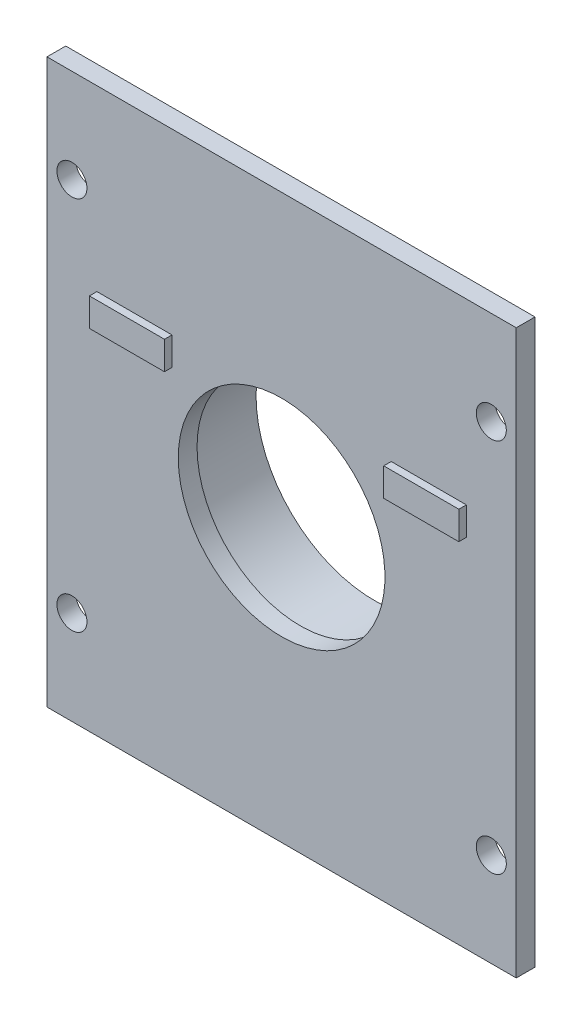
ISO-10303-21;
HEADER;
FILE_DESCRIPTION(('STEP AP214'),'2;1');
FILE_NAME('part.step','',(''),(''),'','','');
FILE_SCHEMA(('AUTOMOTIVE_DESIGN { 1 0 10303 214 1 1 1 1 }'));
ENDSEC;
DATA;
#1=APPLICATION_CONTEXT('core data for automotive mechanical design processes');
#2=APPLICATION_PROTOCOL_DEFINITION('international standard','automotive_design',2000,#1);
#3=PRODUCT_CONTEXT('',#1,'mechanical');
#4=PRODUCT('Part','Part','',(#3));
#5=PRODUCT_RELATED_PRODUCT_CATEGORY('part','',(#4));
#6=PRODUCT_DEFINITION_FORMATION('','',#4);
#7=PRODUCT_DEFINITION_CONTEXT('part definition',#1,'design');
#8=PRODUCT_DEFINITION('design','',#6,#7);
#9=PRODUCT_DEFINITION_SHAPE('','',#8);
#10=(LENGTH_UNIT() NAMED_UNIT(*) SI_UNIT(.MILLI.,.METRE.));
#11=(NAMED_UNIT(*) PLANE_ANGLE_UNIT() SI_UNIT($,.RADIAN.));
#12=(NAMED_UNIT(*) SI_UNIT($,.STERADIAN.) SOLID_ANGLE_UNIT());
#13=UNCERTAINTY_MEASURE_WITH_UNIT(LENGTH_MEASURE(1.E-05),#10,'distance_accuracy_value','');
#14=(GEOMETRIC_REPRESENTATION_CONTEXT(3) GLOBAL_UNCERTAINTY_ASSIGNED_CONTEXT((#13)) GLOBAL_UNIT_ASSIGNED_CONTEXT((#10,
#11,#12)) REPRESENTATION_CONTEXT('',''));
#15=CARTESIAN_POINT('',(0.,0.,0.));
#16=DIRECTION('',(0.,0.,1.));
#17=DIRECTION('',(1.,0.,0.));
#18=AXIS2_PLACEMENT_3D('',#15,#16,#17);
#19=CARTESIAN_POINT('',(0.,0.,2.54));
#20=DIRECTION('',(0.,0.,-1.));
#21=DIRECTION('',(-1.,0.,0.));
#22=AXIS2_PLACEMENT_3D('',#19,#20,#21);
#23=PLANE('',#22);
#24=DIRECTION('',(-1.,0.,0.));
#25=VECTOR('',#24,1.);
#26=CARTESIAN_POINT('',(46.5836,52.07,2.54));
#27=LINE('',#26,#25);
#28=CARTESIAN_POINT('',(56.7436,52.07,2.54));
#29=VERTEX_POINT('',#28);
#30=CARTESIAN_POINT('',(46.5836,52.07,2.54));
#31=VERTEX_POINT('',#30);
#32=EDGE_CURVE('E143',#29,#31,#27,.T.);
#33=ORIENTED_EDGE('',*,*,#32,.F.);
#34=DIRECTION('',(0.,1.,0.));
#35=VECTOR('',#34,1.);
#36=CARTESIAN_POINT('',(56.7436,52.07,2.54));
#37=LINE('',#36,#35);
#38=CARTESIAN_POINT('',(56.7436,48.26,2.54));
#39=VERTEX_POINT('',#38);
#40=EDGE_CURVE('E156',#39,#29,#37,.T.);
#41=ORIENTED_EDGE('',*,*,#40,.F.);
#42=DIRECTION('',(1.,0.,0.));
#43=VECTOR('',#42,1.);
#44=CARTESIAN_POINT('',(46.5836,48.26,2.54));
#45=LINE('',#44,#43);
#46=CARTESIAN_POINT('',(46.5836,48.26,2.54));
#47=VERTEX_POINT('',#46);
#48=EDGE_CURVE('E165',#47,#39,#45,.T.);
#49=ORIENTED_EDGE('',*,*,#48,.F.);
#50=DIRECTION('',(0.,-1.,0.));
#51=VECTOR('',#50,1.);
#52=CARTESIAN_POINT('',(46.5836,48.26,2.54));
#53=LINE('',#52,#51);
#54=EDGE_CURVE('E146',#31,#47,#53,.T.);
#55=ORIENTED_EDGE('',*,*,#54,.F.);
#56=EDGE_LOOP('',(#33,#41,#49,#55));
#57=FACE_BOUND('',#56,.T.);
#58=CARTESIAN_POINT('',(3.375,12.7,2.54));
#59=DIRECTION('',(0.,0.,-1.));
#60=DIRECTION('',(1.,0.,0.));
#61=AXIS2_PLACEMENT_3D('',#58,#59,#60);
#62=CIRCLE('',#61,2.032);
#63=CARTESIAN_POINT('',(5.407,12.7,2.54));
#64=VERTEX_POINT('',#63);
#65=EDGE_CURVE('E182',#64,#64,#62,.T.);
#66=ORIENTED_EDGE('',*,*,#65,.T.);
#67=EDGE_LOOP('',(#66));
#68=FACE_BOUND('',#67,.T.);
#69=CARTESIAN_POINT('',(60.125,12.7,2.54));
#70=DIRECTION('',(0.,0.,-1.));
#71=DIRECTION('',(-1.,0.,0.));
#72=AXIS2_PLACEMENT_3D('',#69,#70,#71);
#73=CIRCLE('',#72,2.03200000000002);
#74=CARTESIAN_POINT('',(58.093,12.7,2.54));
#75=VERTEX_POINT('',#74);
#76=EDGE_CURVE('E188',#75,#75,#73,.T.);
#77=ORIENTED_EDGE('',*,*,#76,.T.);
#78=EDGE_LOOP('',(#77));
#79=FACE_BOUND('',#78,.T.);
#80=CARTESIAN_POINT('',(60.125,63.5,2.54));
#81=DIRECTION('',(0.,0.,-1.));
#82=DIRECTION('',(1.,0.,0.));
#83=AXIS2_PLACEMENT_3D('',#80,#81,#82);
#84=CIRCLE('',#83,2.03200000000002);
#85=CARTESIAN_POINT('',(62.157,63.5,2.54));
#86=VERTEX_POINT('',#85);
#87=EDGE_CURVE('E194',#86,#86,#84,.T.);
#88=ORIENTED_EDGE('',*,*,#87,.T.);
#89=EDGE_LOOP('',(#88));
#90=FACE_BOUND('',#89,.T.);
#91=CARTESIAN_POINT('',(3.37500000000002,63.5,2.54));
#92=DIRECTION('',(0.,0.,-1.));
#93=DIRECTION('',(-1.,0.,0.));
#94=AXIS2_PLACEMENT_3D('',#91,#92,#93);
#95=CIRCLE('',#94,2.032);
#96=CARTESIAN_POINT('',(1.34300000000001,63.5,2.54));
#97=VERTEX_POINT('',#96);
#98=EDGE_CURVE('E200',#97,#97,#95,.T.);
#99=ORIENTED_EDGE('',*,*,#98,.T.);
#100=EDGE_LOOP('',(#99));
#101=FACE_BOUND('',#100,.T.);
#102=CARTESIAN_POINT('',(31.75,38.1,2.54));
#103=DIRECTION('',(0.,0.,-1.));
#104=DIRECTION('',(-1.,0.,0.));
#105=AXIS2_PLACEMENT_3D('',#102,#103,#104);
#106=CIRCLE('',#105,13.983999972);
#107=CARTESIAN_POINT('',(17.766000028,38.1,2.54));
#108=VERTEX_POINT('',#107);
#109=EDGE_CURVE('E208',#108,#108,#106,.T.);
#110=ORIENTED_EDGE('',*,*,#109,.T.);
#111=EDGE_LOOP('',(#110));
#112=FACE_BOUND('',#111,.T.);
#113=DIRECTION('',(0.,-1.,0.));
#114=VECTOR('',#113,1.);
#115=CARTESIAN_POINT('',(0.,0.,2.54));
#116=LINE('',#115,#114);
#117=CARTESIAN_POINT('',(0.,76.2,2.54));
#118=VERTEX_POINT('',#117);
#119=CARTESIAN_POINT('',(0.,0.,2.54));
#120=VERTEX_POINT('',#119);
#121=EDGE_CURVE('E221',#118,#120,#116,.T.);
#122=ORIENTED_EDGE('',*,*,#121,.T.);
#123=DIRECTION('',(1.,0.,0.));
#124=VECTOR('',#123,1.);
#125=CARTESIAN_POINT('',(0.,0.,2.54));
#126=LINE('',#125,#124);
#127=CARTESIAN_POINT('',(63.5,0.,2.54));
#128=VERTEX_POINT('',#127);
#129=EDGE_CURVE('E224',#120,#128,#126,.T.);
#130=ORIENTED_EDGE('',*,*,#129,.T.);
#131=DIRECTION('',(0.,1.,0.));
#132=VECTOR('',#131,1.);
#133=CARTESIAN_POINT('',(63.5,0.,2.54));
#134=LINE('',#133,#132);
#135=CARTESIAN_POINT('',(63.5,76.2,2.54));
#136=VERTEX_POINT('',#135);
#137=EDGE_CURVE('E227',#128,#136,#134,.T.);
#138=ORIENTED_EDGE('',*,*,#137,.T.);
#139=DIRECTION('',(-1.,0.,0.));
#140=VECTOR('',#139,1.);
#141=CARTESIAN_POINT('',(0.,76.2,2.54));
#142=LINE('',#141,#140);
#143=EDGE_CURVE('E229',#136,#118,#142,.T.);
#144=ORIENTED_EDGE('',*,*,#143,.T.);
#145=EDGE_LOOP('',(#122,#130,#138,#144));
#146=FACE_BOUND('',#145,.T.);
#147=DIRECTION('',(1.,0.,0.));
#148=VECTOR('',#147,1.);
#149=CARTESIAN_POINT('',(6.7564,48.26,2.54));
#150=LINE('',#149,#148);
#151=CARTESIAN_POINT('',(6.7564,48.26,2.54));
#152=VERTEX_POINT('',#151);
#153=CARTESIAN_POINT('',(16.9164,48.26,2.54));
#154=VERTEX_POINT('',#153);
#155=EDGE_CURVE('E142',#152,#154,#150,.T.);
#156=ORIENTED_EDGE('',*,*,#155,.F.);
#157=DIRECTION('',(0.,-1.,0.));
#158=VECTOR('',#157,1.);
#159=CARTESIAN_POINT('',(6.7564,52.07,2.54));
#160=LINE('',#159,#158);
#161=CARTESIAN_POINT('',(6.7564,52.07,2.54));
#162=VERTEX_POINT('',#161);
#163=EDGE_CURVE('E139',#162,#152,#160,.T.);
#164=ORIENTED_EDGE('',*,*,#163,.F.);
#165=DIRECTION('',(-1.,0.,0.));
#166=VECTOR('',#165,1.);
#167=CARTESIAN_POINT('',(16.9164,52.07,2.54));
#168=LINE('',#167,#166);
#169=CARTESIAN_POINT('',(16.9164,52.07,2.54));
#170=VERTEX_POINT('',#169);
#171=EDGE_CURVE('E53',#170,#162,#168,.T.);
#172=ORIENTED_EDGE('',*,*,#171,.F.);
#173=DIRECTION('',(0.,1.,0.));
#174=VECTOR('',#173,1.);
#175=CARTESIAN_POINT('',(16.9164,48.26,2.54));
#176=LINE('',#175,#174);
#177=EDGE_CURVE('E48',#154,#170,#176,.T.);
#178=ORIENTED_EDGE('',*,*,#177,.F.);
#179=EDGE_LOOP('',(#156,#164,#172,#178));
#180=FACE_BOUND('',#179,.T.);
#181=ADVANCED_FACE('F33',(#57,#68,#79,#90,#101,#112,#146,#180),#23,.F.);
#182=CARTESIAN_POINT('',(0.,0.,0.));
#183=DIRECTION('',(0.,0.,-1.));
#184=DIRECTION('',(-1.,0.,0.));
#185=AXIS2_PLACEMENT_3D('',#182,#183,#184);
#186=PLANE('',#185);
#187=CARTESIAN_POINT('',(3.375,12.7,0.));
#188=DIRECTION('',(0.,0.,-1.));
#189=DIRECTION('',(1.,0.,0.));
#190=AXIS2_PLACEMENT_3D('',#187,#188,#189);
#191=CIRCLE('',#190,2.032);
#192=CARTESIAN_POINT('',(5.407,12.7,0.));
#193=VERTEX_POINT('',#192);
#194=EDGE_CURVE('E181',#193,#193,#191,.T.);
#195=ORIENTED_EDGE('',*,*,#194,.F.);
#196=EDGE_LOOP('',(#195));
#197=FACE_BOUND('',#196,.T.);
#198=CARTESIAN_POINT('',(60.125,12.7,0.));
#199=DIRECTION('',(0.,0.,-1.));
#200=DIRECTION('',(-1.,0.,0.));
#201=AXIS2_PLACEMENT_3D('',#198,#199,#200);
#202=CIRCLE('',#201,2.03200000000002);
#203=CARTESIAN_POINT('',(58.093,12.7,0.));
#204=VERTEX_POINT('',#203);
#205=EDGE_CURVE('E185',#204,#204,#202,.T.);
#206=ORIENTED_EDGE('',*,*,#205,.F.);
#207=EDGE_LOOP('',(#206));
#208=FACE_BOUND('',#207,.T.);
#209=CARTESIAN_POINT('',(60.125,63.5,0.));
#210=DIRECTION('',(0.,0.,-1.));
#211=DIRECTION('',(1.,0.,0.));
#212=AXIS2_PLACEMENT_3D('',#209,#210,#211);
#213=CIRCLE('',#212,2.03200000000002);
#214=CARTESIAN_POINT('',(62.157,63.5,0.));
#215=VERTEX_POINT('',#214);
#216=EDGE_CURVE('E191',#215,#215,#213,.T.);
#217=ORIENTED_EDGE('',*,*,#216,.F.);
#218=EDGE_LOOP('',(#217));
#219=FACE_BOUND('',#218,.T.);
#220=CARTESIAN_POINT('',(3.37500000000002,63.5,0.));
#221=DIRECTION('',(0.,0.,-1.));
#222=DIRECTION('',(-1.,0.,0.));
#223=AXIS2_PLACEMENT_3D('',#220,#221,#222);
#224=CIRCLE('',#223,2.032);
#225=CARTESIAN_POINT('',(1.34300000000001,63.5,0.));
#226=VERTEX_POINT('',#225);
#227=EDGE_CURVE('E197',#226,#226,#224,.T.);
#228=ORIENTED_EDGE('',*,*,#227,.F.);
#229=EDGE_LOOP('',(#228));
#230=FACE_BOUND('',#229,.T.);
#231=DIRECTION('',(0.,-1.,0.));
#232=VECTOR('',#231,1.);
#233=CARTESIAN_POINT('',(0.,0.,0.));
#234=LINE('',#233,#232);
#235=CARTESIAN_POINT('',(0.,76.2,0.));
#236=VERTEX_POINT('',#235);
#237=CARTESIAN_POINT('',(0.,0.,0.));
#238=VERTEX_POINT('',#237);
#239=EDGE_CURVE('E218',#236,#238,#234,.T.);
#240=ORIENTED_EDGE('',*,*,#239,.F.);
#241=DIRECTION('',(-1.,0.,0.));
#242=VECTOR('',#241,1.);
#243=CARTESIAN_POINT('',(0.,76.2,0.));
#244=LINE('',#243,#242);
#245=CARTESIAN_POINT('',(63.5,76.2,0.));
#246=VERTEX_POINT('',#245);
#247=EDGE_CURVE('E225',#246,#236,#244,.T.);
#248=ORIENTED_EDGE('',*,*,#247,.F.);
#249=DIRECTION('',(0.,1.,0.));
#250=VECTOR('',#249,1.);
#251=CARTESIAN_POINT('',(63.5,0.,0.));
#252=LINE('',#251,#250);
#253=CARTESIAN_POINT('',(63.5,0.,0.));
#254=VERTEX_POINT('',#253);
#255=EDGE_CURVE('E236',#254,#246,#252,.T.);
#256=ORIENTED_EDGE('',*,*,#255,.F.);
#257=DIRECTION('',(1.,0.,0.));
#258=VECTOR('',#257,1.);
#259=CARTESIAN_POINT('',(0.,0.,0.));
#260=LINE('',#259,#258);
#261=EDGE_CURVE('E234',#238,#254,#260,.T.);
#262=ORIENTED_EDGE('',*,*,#261,.F.);
#263=EDGE_LOOP('',(#240,#248,#256,#262));
#264=FACE_BOUND('',#263,.T.);
#265=CARTESIAN_POINT('',(31.75,38.1,0.));
#266=DIRECTION('',(0.,0.,-1.));
#267=DIRECTION('',(-1.,0.,0.));
#268=AXIS2_PLACEMENT_3D('',#265,#266,#267);
#269=CIRCLE('',#268,17.270000004);
#270=CARTESIAN_POINT('',(14.479999996,38.1,0.));
#271=VERTEX_POINT('',#270);
#272=EDGE_CURVE('E214',#271,#271,#269,.T.);
#273=ORIENTED_EDGE('',*,*,#272,.F.);
#274=EDGE_LOOP('',(#273));
#275=FACE_BOUND('',#274,.T.);
#276=ADVANCED_FACE('F257',(#197,#208,#219,#230,#264,#275),#186,.T.);
#277=CARTESIAN_POINT('',(0.,0.,2.54));
#278=DIRECTION('',(1.,0.,0.));
#279=DIRECTION('',(0.,0.,-1.));
#280=AXIS2_PLACEMENT_3D('',#277,#278,#279);
#281=PLANE('',#280);
#282=ORIENTED_EDGE('',*,*,#239,.T.);
#283=DIRECTION('',(0.,0.,-1.));
#284=VECTOR('',#283,1.);
#285=CARTESIAN_POINT('',(0.,0.,2.54));
#286=LINE('',#285,#284);
#287=EDGE_CURVE('E41',#120,#238,#286,.T.);
#288=ORIENTED_EDGE('',*,*,#287,.F.);
#289=ORIENTED_EDGE('',*,*,#121,.F.);
#290=DIRECTION('',(0.,0.,-1.));
#291=VECTOR('',#290,1.);
#292=CARTESIAN_POINT('',(0.,76.2,2.54));
#293=LINE('',#292,#291);
#294=EDGE_CURVE('E231',#118,#236,#293,.T.);
#295=ORIENTED_EDGE('',*,*,#294,.T.);
#296=EDGE_LOOP('',(#282,#288,#289,#295));
#297=FACE_BOUND('',#296,.T.);
#298=ADVANCED_FACE('F35',(#297),#281,.F.);
#299=CARTESIAN_POINT('',(0.,0.,2.54));
#300=DIRECTION('',(0.,1.,0.));
#301=DIRECTION('',(0.,0.,1.));
#302=AXIS2_PLACEMENT_3D('',#299,#300,#301);
#303=PLANE('',#302);
#304=ORIENTED_EDGE('',*,*,#261,.T.);
#305=DIRECTION('',(0.,0.,-1.));
#306=VECTOR('',#305,1.);
#307=CARTESIAN_POINT('',(63.5,0.,2.54));
#308=LINE('',#307,#306);
#309=EDGE_CURVE('E244',#128,#254,#308,.T.);
#310=ORIENTED_EDGE('',*,*,#309,.F.);
#311=ORIENTED_EDGE('',*,*,#129,.F.);
#312=ORIENTED_EDGE('',*,*,#287,.T.);
#313=EDGE_LOOP('',(#304,#310,#311,#312));
#314=FACE_BOUND('',#313,.T.);
#315=ADVANCED_FACE('F249',(#314),#303,.F.);
#316=CARTESIAN_POINT('',(63.5,0.,2.54));
#317=DIRECTION('',(-1.,0.,0.));
#318=DIRECTION('',(0.,0.,1.));
#319=AXIS2_PLACEMENT_3D('',#316,#317,#318);
#320=PLANE('',#319);
#321=ORIENTED_EDGE('',*,*,#255,.T.);
#322=DIRECTION('',(0.,0.,-1.));
#323=VECTOR('',#322,1.);
#324=CARTESIAN_POINT('',(63.5,76.2,2.54));
#325=LINE('',#324,#323);
#326=EDGE_CURVE('E241',#136,#246,#325,.T.);
#327=ORIENTED_EDGE('',*,*,#326,.F.);
#328=ORIENTED_EDGE('',*,*,#137,.F.);
#329=ORIENTED_EDGE('',*,*,#309,.T.);
#330=EDGE_LOOP('',(#321,#327,#328,#329));
#331=FACE_BOUND('',#330,.T.);
#332=ADVANCED_FACE('F262',(#331),#320,.F.);
#333=CARTESIAN_POINT('',(0.,76.2,2.54));
#334=DIRECTION('',(0.,-1.,0.));
#335=DIRECTION('',(0.,0.,-1.));
#336=AXIS2_PLACEMENT_3D('',#333,#334,#335);
#337=PLANE('',#336);
#338=ORIENTED_EDGE('',*,*,#247,.T.);
#339=ORIENTED_EDGE('',*,*,#294,.F.);
#340=ORIENTED_EDGE('',*,*,#143,.F.);
#341=ORIENTED_EDGE('',*,*,#326,.T.);
#342=EDGE_LOOP('',(#338,#339,#340,#341));
#343=FACE_BOUND('',#342,.T.);
#344=ADVANCED_FACE('F266',(#343),#337,.F.);
#345=CARTESIAN_POINT('',(31.75,38.1,-10.));
#346=DIRECTION('',(0.,0.,-1.));
#347=DIRECTION('',(-1.,0.,0.));
#348=AXIS2_PLACEMENT_3D('',#345,#346,#347);
#349=PLANE('',#348);
#350=CARTESIAN_POINT('',(31.75,38.1,-10.));
#351=DIRECTION('',(0.,0.,-1.));
#352=DIRECTION('',(-1.,0.,0.));
#353=AXIS2_PLACEMENT_3D('',#350,#351,#352);
#354=CIRCLE('',#353,17.270000004);
#355=CARTESIAN_POINT('',(14.479999996,38.1,-10.));
#356=VERTEX_POINT('',#355);
#357=EDGE_CURVE('E215',#356,#356,#354,.T.);
#358=ORIENTED_EDGE('',*,*,#357,.T.);
#359=EDGE_LOOP('',(#358));
#360=FACE_BOUND('',#359,.T.);
#361=CARTESIAN_POINT('',(31.75,38.1,-10.));
#362=DIRECTION('',(0.,0.,-1.));
#363=DIRECTION('',(-1.,0.,0.));
#364=AXIS2_PLACEMENT_3D('',#361,#362,#363);
#365=CIRCLE('',#364,16.000000004);
#366=CARTESIAN_POINT('',(15.749999996,38.1,-10.));
#367=VERTEX_POINT('',#366);
#368=EDGE_CURVE('E211',#367,#367,#365,.T.);
#369=ORIENTED_EDGE('',*,*,#368,.F.);
#370=EDGE_LOOP('',(#369));
#371=FACE_BOUND('',#370,.T.);
#372=ADVANCED_FACE('F344',(#360,#371),#349,.T.);
#373=CARTESIAN_POINT('',(31.75,38.1,-10.));
#374=DIRECTION('',(0.,0.,1.));
#375=DIRECTION('',(1.,0.,0.));
#376=AXIS2_PLACEMENT_3D('',#373,#374,#375);
#377=CYLINDRICAL_SURFACE('',#376,17.270000004);
#378=ORIENTED_EDGE('',*,*,#357,.F.);
#379=EDGE_LOOP('',(#378));
#380=FACE_BOUND('',#379,.T.);
#381=ORIENTED_EDGE('',*,*,#272,.T.);
#382=EDGE_LOOP('',(#381));
#383=FACE_BOUND('',#382,.T.);
#384=ADVANCED_FACE('F342',(#380,#383),#377,.T.);
#385=CARTESIAN_POINT('',(31.75,38.1,-10.));
#386=DIRECTION('',(0.,0.,1.));
#387=DIRECTION('',(1.,0.,0.));
#388=AXIS2_PLACEMENT_3D('',#385,#386,#387);
#389=CYLINDRICAL_SURFACE('',#388,16.000000004);
#390=ORIENTED_EDGE('',*,*,#368,.T.);
#391=EDGE_LOOP('',(#390));
#392=FACE_BOUND('',#391,.T.);
#393=CARTESIAN_POINT('',(31.75,38.1,0.));
#394=DIRECTION('',(0.,0.,-1.));
#395=DIRECTION('',(-1.,0.,0.));
#396=AXIS2_PLACEMENT_3D('',#393,#394,#395);
#397=CIRCLE('',#396,16.000000004);
#398=CARTESIAN_POINT('',(15.749999996,38.1,0.));
#399=VERTEX_POINT('',#398);
#400=EDGE_CURVE('E11',#399,#399,#397,.F.);
#401=ORIENTED_EDGE('',*,*,#400,.T.);
#402=EDGE_LOOP('',(#401));
#403=FACE_BOUND('',#402,.T.);
#404=ADVANCED_FACE('F339',(#392,#403),#389,.F.);
#405=CARTESIAN_POINT('',(31.75,38.1,0.));
#406=DIRECTION('',(0.,0.,-1.));
#407=DIRECTION('',(-1.,0.,0.));
#408=AXIS2_PLACEMENT_3D('',#405,#406,#407);
#409=CIRCLE('',#408,13.983999972);
#410=CARTESIAN_POINT('',(17.766000028,38.1,0.));
#411=VERTEX_POINT('',#410);
#412=EDGE_CURVE('E203',#411,#411,#409,.T.);
#413=ORIENTED_EDGE('',*,*,#412,.F.);
#414=EDGE_LOOP('',(#413));
#415=FACE_BOUND('',#414,.T.);
#416=ORIENTED_EDGE('',*,*,#400,.F.);
#417=EDGE_LOOP('',(#416));
#418=FACE_BOUND('',#417,.T.);
#419=ADVANCED_FACE('F337',(#415,#418),#186,.T.);
#420=CARTESIAN_POINT('',(31.75,38.1,10.0076));
#421=DIRECTION('',(0.,0.,-1.));
#422=DIRECTION('',(-1.,0.,0.));
#423=AXIS2_PLACEMENT_3D('',#420,#421,#422);
#424=CYLINDRICAL_SURFACE('',#423,13.983999972);
#425=ORIENTED_EDGE('',*,*,#412,.T.);
#426=EDGE_LOOP('',(#425));
#427=FACE_BOUND('',#426,.T.);
#428=ORIENTED_EDGE('',*,*,#109,.F.);
#429=EDGE_LOOP('',(#428));
#430=FACE_BOUND('',#429,.T.);
#431=ADVANCED_FACE('F333',(#427,#430),#424,.F.);
#432=CARTESIAN_POINT('',(3.37500000000002,63.5,2.54));
#433=DIRECTION('',(0.,0.,-1.));
#434=DIRECTION('',(-1.,0.,0.));
#435=AXIS2_PLACEMENT_3D('',#432,#433,#434);
#436=CYLINDRICAL_SURFACE('',#435,2.032);
#437=ORIENTED_EDGE('',*,*,#98,.F.);
#438=EDGE_LOOP('',(#437));
#439=FACE_BOUND('',#438,.T.);
#440=ORIENTED_EDGE('',*,*,#227,.T.);
#441=EDGE_LOOP('',(#440));
#442=FACE_BOUND('',#441,.T.);
#443=ADVANCED_FACE('F329',(#439,#442),#436,.F.);
#444=CARTESIAN_POINT('',(60.125,63.5,2.54));
#445=DIRECTION('',(0.,0.,-1.));
#446=DIRECTION('',(-1.,0.,0.));
#447=AXIS2_PLACEMENT_3D('',#444,#445,#446);
#448=CYLINDRICAL_SURFACE('',#447,2.03200000000002);
#449=ORIENTED_EDGE('',*,*,#87,.F.);
#450=EDGE_LOOP('',(#449));
#451=FACE_BOUND('',#450,.T.);
#452=ORIENTED_EDGE('',*,*,#216,.T.);
#453=EDGE_LOOP('',(#452));
#454=FACE_BOUND('',#453,.T.);
#455=ADVANCED_FACE('F325',(#451,#454),#448,.F.);
#456=CARTESIAN_POINT('',(60.125,12.7,2.54));
#457=DIRECTION('',(0.,0.,-1.));
#458=DIRECTION('',(-1.,0.,0.));
#459=AXIS2_PLACEMENT_3D('',#456,#457,#458);
#460=CYLINDRICAL_SURFACE('',#459,2.03200000000002);
#461=ORIENTED_EDGE('',*,*,#76,.F.);
#462=EDGE_LOOP('',(#461));
#463=FACE_BOUND('',#462,.T.);
#464=ORIENTED_EDGE('',*,*,#205,.T.);
#465=EDGE_LOOP('',(#464));
#466=FACE_BOUND('',#465,.T.);
#467=ADVANCED_FACE('F321',(#463,#466),#460,.F.);
#468=CARTESIAN_POINT('',(3.375,12.7,2.54));
#469=DIRECTION('',(0.,0.,-1.));
#470=DIRECTION('',(-1.,0.,0.));
#471=AXIS2_PLACEMENT_3D('',#468,#469,#470);
#472=CYLINDRICAL_SURFACE('',#471,2.032);
#473=ORIENTED_EDGE('',*,*,#65,.F.);
#474=EDGE_LOOP('',(#473));
#475=FACE_BOUND('',#474,.T.);
#476=ORIENTED_EDGE('',*,*,#194,.T.);
#477=EDGE_LOOP('',(#476));
#478=FACE_BOUND('',#477,.T.);
#479=ADVANCED_FACE('F317',(#475,#478),#472,.F.);
#480=CARTESIAN_POINT('',(46.5836,52.07,3.556));
#481=DIRECTION('',(0.,-1.,0.));
#482=DIRECTION('',(0.,0.,-1.));
#483=AXIS2_PLACEMENT_3D('',#480,#481,#482);
#484=PLANE('',#483);
#485=ORIENTED_EDGE('',*,*,#32,.T.);
#486=DIRECTION('',(0.,0.,-1.));
#487=VECTOR('',#486,1.);
#488=CARTESIAN_POINT('',(46.5836,52.07,3.556));
#489=LINE('',#488,#487);
#490=CARTESIAN_POINT('',(46.5836,52.07,3.556));
#491=VERTEX_POINT('',#490);
#492=EDGE_CURVE('E178',#491,#31,#489,.T.);
#493=ORIENTED_EDGE('',*,*,#492,.F.);
#494=DIRECTION('',(-1.,0.,0.));
#495=VECTOR('',#494,1.);
#496=CARTESIAN_POINT('',(46.5836,52.07,3.556));
#497=LINE('',#496,#495);
#498=CARTESIAN_POINT('',(56.7436,52.07,3.556));
#499=VERTEX_POINT('',#498);
#500=EDGE_CURVE('E152',#499,#491,#497,.T.);
#501=ORIENTED_EDGE('',*,*,#500,.F.);
#502=DIRECTION('',(0.,0.,-1.));
#503=VECTOR('',#502,1.);
#504=CARTESIAN_POINT('',(56.7436,52.07,3.556));
#505=LINE('',#504,#503);
#506=EDGE_CURVE('E161',#499,#29,#505,.T.);
#507=ORIENTED_EDGE('',*,*,#506,.T.);
#508=EDGE_LOOP('',(#485,#493,#501,#507));
#509=FACE_BOUND('',#508,.T.);
#510=ADVANCED_FACE('F313',(#509),#484,.F.);
#511=CARTESIAN_POINT('',(46.5836,48.26,3.556));
#512=DIRECTION('',(1.,0.,0.));
#513=DIRECTION('',(0.,0.,-1.));
#514=AXIS2_PLACEMENT_3D('',#511,#512,#513);
#515=PLANE('',#514);
#516=ORIENTED_EDGE('',*,*,#54,.T.);
#517=DIRECTION('',(0.,0.,-1.));
#518=VECTOR('',#517,1.);
#519=CARTESIAN_POINT('',(46.5836,48.26,3.556));
#520=LINE('',#519,#518);
#521=CARTESIAN_POINT('',(46.5836,48.26,3.556));
#522=VERTEX_POINT('',#521);
#523=EDGE_CURVE('E175',#522,#47,#520,.T.);
#524=ORIENTED_EDGE('',*,*,#523,.F.);
#525=DIRECTION('',(0.,-1.,0.));
#526=VECTOR('',#525,1.);
#527=CARTESIAN_POINT('',(46.5836,48.26,3.556));
#528=LINE('',#527,#526);
#529=EDGE_CURVE('E155',#491,#522,#528,.T.);
#530=ORIENTED_EDGE('',*,*,#529,.F.);
#531=ORIENTED_EDGE('',*,*,#492,.T.);
#532=EDGE_LOOP('',(#516,#524,#530,#531));
#533=FACE_BOUND('',#532,.T.);
#534=ADVANCED_FACE('F309',(#533),#515,.F.);
#535=CARTESIAN_POINT('',(46.5836,48.26,3.556));
#536=DIRECTION('',(0.,1.,0.));
#537=DIRECTION('',(0.,0.,1.));
#538=AXIS2_PLACEMENT_3D('',#535,#536,#537);
#539=PLANE('',#538);
#540=ORIENTED_EDGE('',*,*,#48,.T.);
#541=DIRECTION('',(0.,0.,-1.));
#542=VECTOR('',#541,1.);
#543=CARTESIAN_POINT('',(56.7436,48.26,3.556));
#544=LINE('',#543,#542);
#545=CARTESIAN_POINT('',(56.7436,48.26,3.556));
#546=VERTEX_POINT('',#545);
#547=EDGE_CURVE('E172',#546,#39,#544,.T.);
#548=ORIENTED_EDGE('',*,*,#547,.F.);
#549=DIRECTION('',(1.,0.,0.));
#550=VECTOR('',#549,1.);
#551=CARTESIAN_POINT('',(46.5836,48.26,3.556));
#552=LINE('',#551,#550);
#553=EDGE_CURVE('E158',#522,#546,#552,.T.);
#554=ORIENTED_EDGE('',*,*,#553,.F.);
#555=ORIENTED_EDGE('',*,*,#523,.T.);
#556=EDGE_LOOP('',(#540,#548,#554,#555));
#557=FACE_BOUND('',#556,.T.);
#558=ADVANCED_FACE('F305',(#557),#539,.F.);
#559=CARTESIAN_POINT('',(56.7436,52.07,3.556));
#560=DIRECTION('',(-1.,0.,0.));
#561=DIRECTION('',(0.,-1.,0.));
#562=AXIS2_PLACEMENT_3D('',#559,#560,#561);
#563=PLANE('',#562);
#564=ORIENTED_EDGE('',*,*,#40,.T.);
#565=ORIENTED_EDGE('',*,*,#506,.F.);
#566=DIRECTION('',(0.,1.,0.));
#567=VECTOR('',#566,1.);
#568=CARTESIAN_POINT('',(56.7436,52.07,3.556));
#569=LINE('',#568,#567);
#570=EDGE_CURVE('E160',#546,#499,#569,.T.);
#571=ORIENTED_EDGE('',*,*,#570,.F.);
#572=ORIENTED_EDGE('',*,*,#547,.T.);
#573=EDGE_LOOP('',(#564,#565,#571,#572));
#574=FACE_BOUND('',#573,.T.);
#575=ADVANCED_FACE('F301',(#574),#563,.F.);
#576=CARTESIAN_POINT('',(0.,0.,3.556));
#577=DIRECTION('',(0.,0.,-1.));
#578=DIRECTION('',(-1.,0.,0.));
#579=AXIS2_PLACEMENT_3D('',#576,#577,#578);
#580=PLANE('',#579);
#581=ORIENTED_EDGE('',*,*,#500,.T.);
#582=ORIENTED_EDGE('',*,*,#529,.T.);
#583=ORIENTED_EDGE('',*,*,#553,.T.);
#584=ORIENTED_EDGE('',*,*,#570,.T.);
#585=EDGE_LOOP('',(#581,#582,#583,#584));
#586=FACE_BOUND('',#585,.T.);
#587=ADVANCED_FACE('F298',(#586),#580,.F.);
#588=CARTESIAN_POINT('',(6.7564,48.26,3.556));
#589=DIRECTION('',(0.,1.,0.));
#590=DIRECTION('',(0.,0.,1.));
#591=AXIS2_PLACEMENT_3D('',#588,#589,#590);
#592=PLANE('',#591);
#593=ORIENTED_EDGE('',*,*,#155,.T.);
#594=DIRECTION('',(0.,0.,-1.));
#595=VECTOR('',#594,1.);
#596=CARTESIAN_POINT('',(16.9164,48.26,3.556));
#597=LINE('',#596,#595);
#598=CARTESIAN_POINT('',(16.9164,48.26,3.556));
#599=VERTEX_POINT('',#598);
#600=EDGE_CURVE('E123',#599,#154,#597,.T.);
#601=ORIENTED_EDGE('',*,*,#600,.F.);
#602=DIRECTION('',(1.,0.,0.));
#603=VECTOR('',#602,1.);
#604=CARTESIAN_POINT('',(6.7564,48.26,3.556));
#605=LINE('',#604,#603);
#606=CARTESIAN_POINT('',(6.7564,48.26,3.556));
#607=VERTEX_POINT('',#606);
#608=EDGE_CURVE('E130',#607,#599,#605,.T.);
#609=ORIENTED_EDGE('',*,*,#608,.F.);
#610=DIRECTION('',(0.,0.,-1.));
#611=VECTOR('',#610,1.);
#612=CARTESIAN_POINT('',(6.7564,48.26,3.556));
#613=LINE('',#612,#611);
#614=EDGE_CURVE('E276',#607,#152,#613,.T.);
#615=ORIENTED_EDGE('',*,*,#614,.T.);
#616=EDGE_LOOP('',(#593,#601,#609,#615));
#617=FACE_BOUND('',#616,.T.);
#618=ADVANCED_FACE('F141',(#617),#592,.F.);
#619=CARTESIAN_POINT('',(16.9164,48.26,3.556));
#620=DIRECTION('',(-1.,0.,0.));
#621=DIRECTION('',(0.,-1.,0.));
#622=AXIS2_PLACEMENT_3D('',#619,#620,#621);
#623=PLANE('',#622);
#624=ORIENTED_EDGE('',*,*,#177,.T.);
#625=DIRECTION('',(0.,0.,-1.));
#626=VECTOR('',#625,1.);
#627=CARTESIAN_POINT('',(16.9164,52.07,3.556));
#628=LINE('',#627,#626);
#629=CARTESIAN_POINT('',(16.9164,52.07,3.556));
#630=VERTEX_POINT('',#629);
#631=EDGE_CURVE('E126',#630,#170,#628,.T.);
#632=ORIENTED_EDGE('',*,*,#631,.F.);
#633=DIRECTION('',(0.,1.,0.));
#634=VECTOR('',#633,1.);
#635=CARTESIAN_POINT('',(16.9164,48.26,3.556));
#636=LINE('',#635,#634);
#637=EDGE_CURVE('E119',#599,#630,#636,.T.);
#638=ORIENTED_EDGE('',*,*,#637,.F.);
#639=ORIENTED_EDGE('',*,*,#600,.T.);
#640=EDGE_LOOP('',(#624,#632,#638,#639));
#641=FACE_BOUND('',#640,.T.);
#642=ADVANCED_FACE('F121',(#641),#623,.F.);
#643=CARTESIAN_POINT('',(16.9164,52.07,3.556));
#644=DIRECTION('',(0.,-1.,0.));
#645=DIRECTION('',(0.,0.,-1.));
#646=AXIS2_PLACEMENT_3D('',#643,#644,#645);
#647=PLANE('',#646);
#648=ORIENTED_EDGE('',*,*,#171,.T.);
#649=DIRECTION('',(0.,0.,-1.));
#650=VECTOR('',#649,1.);
#651=CARTESIAN_POINT('',(6.7564,52.07,3.556));
#652=LINE('',#651,#650);
#653=CARTESIAN_POINT('',(6.7564,52.07,3.556));
#654=VERTEX_POINT('',#653);
#655=EDGE_CURVE('E148',#654,#162,#652,.T.);
#656=ORIENTED_EDGE('',*,*,#655,.F.);
#657=DIRECTION('',(-1.,0.,0.));
#658=VECTOR('',#657,1.);
#659=CARTESIAN_POINT('',(16.9164,52.07,3.556));
#660=LINE('',#659,#658);
#661=EDGE_CURVE('E129',#630,#654,#660,.T.);
#662=ORIENTED_EDGE('',*,*,#661,.F.);
#663=ORIENTED_EDGE('',*,*,#631,.T.);
#664=EDGE_LOOP('',(#648,#656,#662,#663));
#665=FACE_BOUND('',#664,.T.);
#666=ADVANCED_FACE('F285',(#665),#647,.F.);
#667=CARTESIAN_POINT('',(6.7564,52.07,3.556));
#668=DIRECTION('',(1.,0.,0.));
#669=DIRECTION('',(0.,0.,-1.));
#670=AXIS2_PLACEMENT_3D('',#667,#668,#669);
#671=PLANE('',#670);
#672=ORIENTED_EDGE('',*,*,#163,.T.);
#673=ORIENTED_EDGE('',*,*,#614,.F.);
#674=DIRECTION('',(0.,-1.,0.));
#675=VECTOR('',#674,1.);
#676=CARTESIAN_POINT('',(6.7564,52.07,3.556));
#677=LINE('',#676,#675);
#678=EDGE_CURVE('E135',#654,#607,#677,.T.);
#679=ORIENTED_EDGE('',*,*,#678,.F.);
#680=ORIENTED_EDGE('',*,*,#655,.T.);
#681=EDGE_LOOP('',(#672,#673,#679,#680));
#682=FACE_BOUND('',#681,.T.);
#683=ADVANCED_FACE('F275',(#682),#671,.F.);
#684=CARTESIAN_POINT('',(0.,0.,3.556));
#685=DIRECTION('',(0.,0.,1.));
#686=DIRECTION('',(1.,0.,0.));
#687=AXIS2_PLACEMENT_3D('',#684,#685,#686);
#688=PLANE('',#687);
#689=ORIENTED_EDGE('',*,*,#608,.T.);
#690=ORIENTED_EDGE('',*,*,#637,.T.);
#691=ORIENTED_EDGE('',*,*,#661,.T.);
#692=ORIENTED_EDGE('',*,*,#678,.T.);
#693=EDGE_LOOP('',(#689,#690,#691,#692));
#694=FACE_BOUND('',#693,.T.);
#695=ADVANCED_FACE('F133',(#694),#688,.T.);
#696=CLOSED_SHELL('',(#181,#276,#298,#315,#332,#344,#372,#384,#404,#419,#431,#443,#455,#467,
#479,#510,#534,#558,#575,#587,#618,#642,#666,#683,#695));
#697=MANIFOLD_SOLID_BREP('B2',#696);
#698=ADVANCED_BREP_SHAPE_REPRESENTATION('',(#18,#697),#14);
#699=SHAPE_DEFINITION_REPRESENTATION(#9,#698);
ENDSEC;
END-ISO-10303-21;
